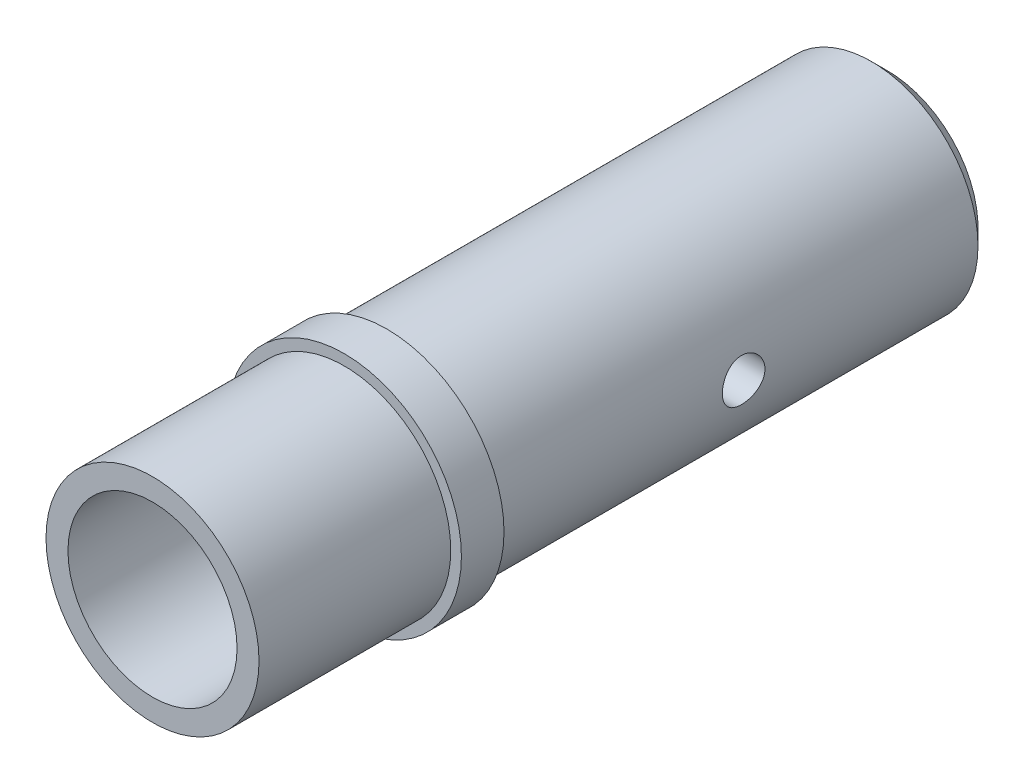
ISO-10303-21;
HEADER;
FILE_DESCRIPTION(('STEP AP214'),'2;1');
FILE_NAME('part.step','',(''),(''),'','','');
FILE_SCHEMA(('AUTOMOTIVE_DESIGN { 1 0 10303 214 1 1 1 1 }'));
ENDSEC;
DATA;
#1=APPLICATION_CONTEXT('core data for automotive mechanical design processes');
#2=APPLICATION_PROTOCOL_DEFINITION('international standard','automotive_design',2000,#1);
#3=PRODUCT_CONTEXT('',#1,'mechanical');
#4=PRODUCT('Part','Part','',(#3));
#5=PRODUCT_RELATED_PRODUCT_CATEGORY('part','',(#4));
#6=PRODUCT_DEFINITION_FORMATION('','',#4);
#7=PRODUCT_DEFINITION_CONTEXT('part definition',#1,'design');
#8=PRODUCT_DEFINITION('design','',#6,#7);
#9=PRODUCT_DEFINITION_SHAPE('','',#8);
#10=(LENGTH_UNIT() NAMED_UNIT(*) SI_UNIT(.MILLI.,.METRE.));
#11=(NAMED_UNIT(*) PLANE_ANGLE_UNIT() SI_UNIT($,.RADIAN.));
#12=(NAMED_UNIT(*) SI_UNIT($,.STERADIAN.) SOLID_ANGLE_UNIT());
#13=UNCERTAINTY_MEASURE_WITH_UNIT(LENGTH_MEASURE(1.E-05),#10,'distance_accuracy_value','');
#14=(GEOMETRIC_REPRESENTATION_CONTEXT(3) GLOBAL_UNCERTAINTY_ASSIGNED_CONTEXT((#13)) GLOBAL_UNIT_ASSIGNED_CONTEXT((#10,
#11,#12)) REPRESENTATION_CONTEXT('',''));
#15=CARTESIAN_POINT('',(0.,0.,0.));
#16=DIRECTION('',(0.,0.,1.));
#17=DIRECTION('',(1.,0.,0.));
#18=AXIS2_PLACEMENT_3D('',#15,#16,#17);
#19=CARTESIAN_POINT('',(0.,0.,18.));
#20=DIRECTION('',(0.,0.,1.));
#21=DIRECTION('',(1.,0.,0.));
#22=AXIS2_PLACEMENT_3D('',#19,#20,#21);
#23=PLANE('',#22);
#24=CARTESIAN_POINT('',(0.,0.,18.));
#25=DIRECTION('',(0.,0.,1.));
#26=DIRECTION('',(1.,0.,0.));
#27=AXIS2_PLACEMENT_3D('',#24,#25,#26);
#28=CIRCLE('',#27,10.);
#29=CARTESIAN_POINT('',(10.,0.,18.));
#30=VERTEX_POINT('',#29);
#31=EDGE_CURVE('E117',#30,#30,#28,.T.);
#32=ORIENTED_EDGE('',*,*,#31,.T.);
#33=EDGE_LOOP('',(#32));
#34=FACE_BOUND('',#33,.T.);
#35=CARTESIAN_POINT('',(0.,0.,18.));
#36=DIRECTION('',(0.,0.,1.));
#37=DIRECTION('',(1.,0.,0.));
#38=AXIS2_PLACEMENT_3D('',#35,#36,#37);
#39=CIRCLE('',#38,7.9375);
#40=CARTESIAN_POINT('',(7.9375,0.,18.));
#41=VERTEX_POINT('',#40);
#42=EDGE_CURVE('E121',#41,#41,#39,.T.);
#43=ORIENTED_EDGE('',*,*,#42,.F.);
#44=EDGE_LOOP('',(#43));
#45=FACE_BOUND('',#44,.T.);
#46=ADVANCED_FACE('F32',(#34,#45),#23,.T.);
#47=CARTESIAN_POINT('',(0.,0.,18.));
#48=DIRECTION('',(0.,0.,-1.));
#49=DIRECTION('',(-1.,0.,0.));
#50=AXIS2_PLACEMENT_3D('',#47,#48,#49);
#51=CYLINDRICAL_SURFACE('',#50,10.);
#52=ORIENTED_EDGE('',*,*,#31,.F.);
#53=EDGE_LOOP('',(#52));
#54=FACE_BOUND('',#53,.T.);
#55=CARTESIAN_POINT('',(0.,0.,0.));
#56=DIRECTION('',(0.,0.,1.));
#57=DIRECTION('',(1.,0.,0.));
#58=AXIS2_PLACEMENT_3D('',#55,#56,#57);
#59=CIRCLE('',#58,10.);
#60=CARTESIAN_POINT('',(10.,0.,0.));
#61=VERTEX_POINT('',#60);
#62=EDGE_CURVE('E120',#61,#61,#59,.T.);
#63=ORIENTED_EDGE('',*,*,#62,.T.);
#64=EDGE_LOOP('',(#63));
#65=FACE_BOUND('',#64,.T.);
#66=ADVANCED_FACE('F106',(#54,#65),#51,.T.);
#67=CARTESIAN_POINT('',(0.,0.,18.));
#68=DIRECTION('',(0.,0.,-1.));
#69=DIRECTION('',(-1.,0.,0.));
#70=AXIS2_PLACEMENT_3D('',#67,#68,#69);
#71=CYLINDRICAL_SURFACE('',#70,7.9375);
#72=ORIENTED_EDGE('',*,*,#42,.T.);
#73=EDGE_LOOP('',(#72));
#74=FACE_BOUND('',#73,.T.);
#75=CARTESIAN_POINT('',(0.,0.,-4.));
#76=DIRECTION('',(0.,0.,-1.));
#77=DIRECTION('',(-1.,0.,0.));
#78=AXIS2_PLACEMENT_3D('',#75,#76,#77);
#79=CIRCLE('',#78,7.9375);
#80=CARTESIAN_POINT('',(-7.9375,0.,-4.));
#81=VERTEX_POINT('',#80);
#82=EDGE_CURVE('E131',#81,#81,#79,.T.);
#83=ORIENTED_EDGE('',*,*,#82,.T.);
#84=EDGE_LOOP('',(#83));
#85=FACE_BOUND('',#84,.T.);
#86=ADVANCED_FACE('F94',(#74,#85),#71,.F.);
#87=CARTESIAN_POINT('',(0.,0.,-4.));
#88=DIRECTION('',(0.,0.,-1.));
#89=DIRECTION('',(-1.,0.,0.));
#90=AXIS2_PLACEMENT_3D('',#87,#88,#89);
#91=PLANE('',#90);
#92=CARTESIAN_POINT('',(0.,0.,-4.));
#93=DIRECTION('',(0.,0.,-1.));
#94=DIRECTION('',(-1.,0.,0.));
#95=AXIS2_PLACEMENT_3D('',#92,#93,#94);
#96=CIRCLE('',#95,10.);
#97=CARTESIAN_POINT('',(-10.,0.,-4.));
#98=VERTEX_POINT('',#97);
#99=EDGE_CURVE('E50',#98,#98,#96,.T.);
#100=ORIENTED_EDGE('',*,*,#99,.F.);
#101=EDGE_LOOP('',(#100));
#102=FACE_BOUND('',#101,.T.);
#103=CARTESIAN_POINT('',(0.,0.,-4.));
#104=DIRECTION('',(0.,0.,-1.));
#105=DIRECTION('',(-1.,0.,0.));
#106=AXIS2_PLACEMENT_3D('',#103,#104,#105);
#107=CIRCLE('',#106,11.);
#108=CARTESIAN_POINT('',(-11.,0.,-4.));
#109=VERTEX_POINT('',#108);
#110=EDGE_CURVE('E122',#109,#109,#107,.T.);
#111=ORIENTED_EDGE('',*,*,#110,.T.);
#112=EDGE_LOOP('',(#111));
#113=FACE_BOUND('',#112,.T.);
#114=ADVANCED_FACE('F89',(#102,#113),#91,.T.);
#115=CARTESIAN_POINT('',(0.,0.,0.));
#116=DIRECTION('',(0.,0.,-1.));
#117=DIRECTION('',(-1.,0.,0.));
#118=AXIS2_PLACEMENT_3D('',#115,#116,#117);
#119=PLANE('',#118);
#120=ORIENTED_EDGE('',*,*,#62,.F.);
#121=EDGE_LOOP('',(#120));
#122=FACE_BOUND('',#121,.T.);
#123=CARTESIAN_POINT('',(0.,0.,0.));
#124=DIRECTION('',(0.,0.,-1.));
#125=DIRECTION('',(-1.,0.,0.));
#126=AXIS2_PLACEMENT_3D('',#123,#124,#125);
#127=CIRCLE('',#126,11.);
#128=CARTESIAN_POINT('',(-11.,0.,0.));
#129=VERTEX_POINT('',#128);
#130=EDGE_CURVE('E126',#129,#129,#127,.T.);
#131=ORIENTED_EDGE('',*,*,#130,.F.);
#132=EDGE_LOOP('',(#131));
#133=FACE_BOUND('',#132,.T.);
#134=ADVANCED_FACE('F93',(#122,#133),#119,.F.);
#135=CARTESIAN_POINT('',(0.,0.,-4.));
#136=DIRECTION('',(0.,0.,1.));
#137=DIRECTION('',(1.,0.,0.));
#138=AXIS2_PLACEMENT_3D('',#135,#136,#137);
#139=CYLINDRICAL_SURFACE('',#138,11.);
#140=ORIENTED_EDGE('',*,*,#110,.F.);
#141=EDGE_LOOP('',(#140));
#142=FACE_BOUND('',#141,.T.);
#143=ORIENTED_EDGE('',*,*,#130,.T.);
#144=EDGE_LOOP('',(#143));
#145=FACE_BOUND('',#144,.T.);
#146=ADVANCED_FACE('F98',(#142,#145),#139,.T.);
#147=CARTESIAN_POINT('',(0.,0.,-51.));
#148=DIRECTION('',(0.,0.,-1.));
#149=DIRECTION('',(-1.,0.,0.));
#150=AXIS2_PLACEMENT_3D('',#147,#148,#149);
#151=PLANE('',#150);
#152=CARTESIAN_POINT('',(0.,0.,-51.));
#153=DIRECTION('',(0.,0.,-1.));
#154=DIRECTION('',(-1.,0.,0.));
#155=AXIS2_PLACEMENT_3D('',#152,#153,#154);
#156=CIRCLE('',#155,8.49999999999999);
#157=CARTESIAN_POINT('',(-8.49999999999999,0.,-51.));
#158=VERTEX_POINT('',#157);
#159=EDGE_CURVE('E45',#158,#158,#156,.T.);
#160=ORIENTED_EDGE('',*,*,#159,.T.);
#161=EDGE_LOOP('',(#160));
#162=FACE_BOUND('',#161,.T.);
#163=CARTESIAN_POINT('',(0.,0.,-51.));
#164=DIRECTION('',(0.,0.,-1.));
#165=DIRECTION('',(-1.,0.,0.));
#166=AXIS2_PLACEMENT_3D('',#163,#164,#165);
#167=CIRCLE('',#166,6.);
#168=CARTESIAN_POINT('',(-6.,0.,-51.));
#169=VERTEX_POINT('',#168);
#170=EDGE_CURVE('E135',#169,#169,#167,.T.);
#171=ORIENTED_EDGE('',*,*,#170,.F.);
#172=EDGE_LOOP('',(#171));
#173=FACE_BOUND('',#172,.T.);
#174=ADVANCED_FACE('F102',(#162,#173),#151,.T.);
#175=CARTESIAN_POINT('',(0.,0.,-4.));
#176=DIRECTION('',(0.,0.,-1.));
#177=DIRECTION('',(-1.,0.,0.));
#178=AXIS2_PLACEMENT_3D('',#175,#176,#177);
#179=PLANE('',#178);
#180=ORIENTED_EDGE('',*,*,#82,.F.);
#181=EDGE_LOOP('',(#180));
#182=FACE_BOUND('',#181,.T.);
#183=CARTESIAN_POINT('',(0.,0.,-4.));
#184=DIRECTION('',(0.,0.,-1.));
#185=DIRECTION('',(-1.,0.,0.));
#186=AXIS2_PLACEMENT_3D('',#183,#184,#185);
#187=CIRCLE('',#186,6.);
#188=CARTESIAN_POINT('',(-6.,0.,-4.));
#189=VERTEX_POINT('',#188);
#190=EDGE_CURVE('E138',#189,#189,#187,.T.);
#191=ORIENTED_EDGE('',*,*,#190,.T.);
#192=EDGE_LOOP('',(#191));
#193=FACE_BOUND('',#192,.T.);
#194=ADVANCED_FACE('F87',(#182,#193),#179,.F.);
#195=CARTESIAN_POINT('',(0.,0.,-51.));
#196=DIRECTION('',(0.,0.,1.));
#197=DIRECTION('',(1.,0.,0.));
#198=AXIS2_PLACEMENT_3D('',#195,#196,#197);
#199=CYLINDRICAL_SURFACE('',#198,10.);
#200=CARTESIAN_POINT('',(10.,0.,-29.5));
#201=CARTESIAN_POINT('',(9.99999795161742,-0.111153813585266,-29.4999959110033));
#202=CARTESIAN_POINT('',(9.99812770356462,-0.222359320403044,-29.4907023140647));
#203=CARTESIAN_POINT('',(9.99084731246463,-0.441627015378038,-29.4538029997695));
#204=CARTESIAN_POINT('',(9.98543435720372,-0.549686635082711,-29.426182734397));
#205=CARTESIAN_POINT('',(9.97167298556573,-0.759460610526624,-29.3535174527584));
#206=CARTESIAN_POINT('',(9.96332738153436,-0.861180935866265,-29.3084891263106));
#207=CARTESIAN_POINT('',(9.94460796070629,-1.05561597772845,-29.2023355049774));
#208=CARTESIAN_POINT('',(9.93423426471414,-1.14833123015162,-29.1412111687856));
#209=CARTESIAN_POINT('',(9.9124433065994,-1.32338695462973,-29.0037230114171));
#210=CARTESIAN_POINT('',(9.90101491008695,-1.40558790231705,-28.9271832892176));
#211=CARTESIAN_POINT('',(9.87848360905177,-1.55607351321606,-28.7614151672166));
#212=CARTESIAN_POINT('',(9.86738073000848,-1.62435708954085,-28.6721857773298));
#213=CARTESIAN_POINT('',(9.8466488362523,-1.74566350669524,-28.4825676139762));
#214=CARTESIAN_POINT('',(9.83703414729892,-1.79854187773173,-28.3820847124073));
#215=CARTESIAN_POINT('',(9.82052536116836,-1.88661133316062,-28.1734363619918));
#216=CARTESIAN_POINT('',(9.81363099523923,-1.92180416487447,-28.0652716733073));
#217=CARTESIAN_POINT('',(9.80345610504409,-1.97305059976965,-27.8458312721842));
#218=CARTESIAN_POINT('',(9.80012940214375,-1.98934899591755,-27.7346149117155));
#219=CARTESIAN_POINT('',(9.79732750121254,-2.00310425545224,-27.5109803572713));
#220=CARTESIAN_POINT('',(9.79785190935681,-2.000563045427,-27.3985622873597));
#221=CARTESIAN_POINT('',(9.80265102296369,-1.97690914620364,-27.177506423958));
#222=CARTESIAN_POINT('',(9.80686905717527,-1.95607708048781,-27.0688371887454));
#223=CARTESIAN_POINT('',(9.81849092320002,-1.8968757692461,-26.856567846674));
#224=CARTESIAN_POINT('',(9.82589490715558,-1.85850568620136,-26.752967982162));
#225=CARTESIAN_POINT('',(9.84311237000816,-1.76504956734944,-26.5529694765928));
#226=CARTESIAN_POINT('',(9.85294179627409,-1.70985230246423,-26.4566242408617));
#227=CARTESIAN_POINT('',(9.87389237546124,-1.58438714914536,-26.2744583000544));
#228=CARTESIAN_POINT('',(9.88501367676732,-1.51411752871366,-26.1886388062977));
#229=CARTESIAN_POINT('',(9.90754042482924,-1.35899986912117,-26.0283411950861));
#230=CARTESIAN_POINT('',(9.9189473842181,-1.27391232242489,-25.9540948642817));
#231=CARTESIAN_POINT('',(9.94057697428817,-1.09237004812402,-25.8208923073976));
#232=CARTESIAN_POINT('',(9.95079958977947,-0.995915174758778,-25.7619362774128));
#233=CARTESIAN_POINT('',(9.96893380321774,-0.794118773757842,-25.660944981548));
#234=CARTESIAN_POINT('',(9.97684177696544,-0.688763639170601,-25.6189362127109));
#235=CARTESIAN_POINT('',(9.98942817975716,-0.47229795289733,-25.5532790519229));
#236=CARTESIAN_POINT('',(9.99410700001063,-0.3611881001449,-25.5296284358527));
#237=CARTESIAN_POINT('',(9.99965343733736,-0.138358811254301,-25.5016870924114));
#238=CARTESIAN_POINT('',(10.0005834930494,-0.0266806566511533,-25.4970791609195));
#239=CARTESIAN_POINT('',(9.99870103860205,0.195849868385427,-25.5064997178844));
#240=CARTESIAN_POINT('',(9.99588873882892,0.306702284887585,-25.5205271587052));
#241=CARTESIAN_POINT('',(9.98687664016035,0.52341131989308,-25.5665567470879));
#242=CARTESIAN_POINT('',(9.98070752808413,0.629303896679805,-25.5983961369958));
#243=CARTESIAN_POINT('',(9.96567104122065,0.834247254999333,-25.6789679653116));
#244=CARTESIAN_POINT('',(9.95680346428454,0.933297523275077,-25.7277016693537));
#245=CARTESIAN_POINT('',(9.93719823066589,1.12308234737243,-25.8413649813026));
#246=CARTESIAN_POINT('',(9.92643900874103,1.21370025350437,-25.9064855620779));
#247=CARTESIAN_POINT('',(9.90429469659765,1.38283603823841,-26.0508183824146));
#248=CARTESIAN_POINT('',(9.89290953936776,1.46135261786152,-26.1300321327997));
#249=CARTESIAN_POINT('',(9.8705860711393,1.60528118154835,-26.3017467037822));
#250=CARTESIAN_POINT('',(9.85965720466609,1.67047540489731,-26.3944314884427));
#251=CARTESIAN_POINT('',(9.83968383592389,1.78437084010241,-26.5896227227134));
#252=CARTESIAN_POINT('',(9.83063925826685,1.8330727118458,-26.6921287791471));
#253=CARTESIAN_POINT('',(9.81553481168766,1.91230368316392,-26.9035364922991));
#254=CARTESIAN_POINT('',(9.80945949744373,1.9429269995821,-27.0124016824206));
#255=CARTESIAN_POINT('',(9.8009487358405,1.98541730325439,-27.2338669069818));
#256=CARTESIAN_POINT('',(9.79851281382223,1.99728673645022,-27.3464664524187));
#257=CARTESIAN_POINT('',(9.79758299262758,2.00184182173494,-27.5700177290886));
#258=CARTESIAN_POINT('',(9.79901838378602,1.99487157614179,-27.680962297854));
#259=CARTESIAN_POINT('',(9.80551146969228,1.96270460820012,-27.90006329981));
#260=CARTESIAN_POINT('',(9.81056913534338,1.9375080322586,-28.0082197553896));
#261=CARTESIAN_POINT('',(9.82370528438317,1.86975713699791,-28.2184554224811));
#262=CARTESIAN_POINT('',(9.83177642037661,1.82724501343469,-28.3205487210048));
#263=CARTESIAN_POINT('',(9.85003429948341,1.72610928920321,-28.5162074414689));
#264=CARTESIAN_POINT('',(9.86022121997788,1.66748433754977,-28.6097721474503));
#265=CARTESIAN_POINT('',(9.88177921046451,1.53461182957283,-28.7874311443006));
#266=CARTESIAN_POINT('',(9.89316745819399,1.46011577447036,-28.8713375305352));
#267=CARTESIAN_POINT('',(9.91572163743909,1.29812873802628,-29.0255724110583));
#268=CARTESIAN_POINT('',(9.92688751726369,1.21063477430667,-29.0958977806345));
#269=CARTESIAN_POINT('',(9.94787664775943,1.02403525817649,-29.2216692878929));
#270=CARTESIAN_POINT('',(9.95768462438492,0.924817768859668,-29.27695200656));
#271=CARTESIAN_POINT('',(9.9747025017,0.718332721881464,-29.3699722451932));
#272=CARTESIAN_POINT('',(9.98191474277232,0.611072521726252,-29.407725579065));
#273=CARTESIAN_POINT('',(9.99152745190741,0.41964297784756,-29.4573038960894));
#274=CARTESIAN_POINT('',(9.99468606316904,0.33656332802757,-29.4732863874155));
#275=CARTESIAN_POINT('',(9.99892308279786,0.168999050420134,-29.4946358247167));
#276=CARTESIAN_POINT('',(10.0000015574631,0.0845144674972382,-29.5000031090195));
#277=CARTESIAN_POINT('',(10.,0.,-29.5));
#278=B_SPLINE_CURVE_WITH_KNOTS('',3,(#200,#201,#202,#203,#204,#205,#206,#207,#208,#209,#210,
#211,#212,#213,#214,#215,#216,#217,#218,#219,#220,#221,#222,#223,#224,#225,#226,#227,#228,#229,
#230,#231,#232,#233,#234,#235,#236,#237,#238,#239,#240,#241,#242,#243,#244,#245,#246,#247,#248,
#249,#250,#251,#252,#253,#254,#255,#256,#257,#258,#259,#260,#261,#262,#263,#264,#265,#266,#267,
#268,#269,#270,#271,#272,#273,#274,#275,#276,#277),.UNSPECIFIED.,.T.,.F.,(4,2,2,2,2,2,2,2,2,2,2,
2,2,2,2,2,2,2,2,2,2,2,2,2,2,2,2,2,2,2,2,2,2,2,2,2,2,2,4),(0.,0.333152261322517,
0.666569301382645,0.99966747050068,1.33274580446172,1.66986534022437,2.00701119349473,
2.34722390011845,2.68740298730395,3.02312370207174,3.3588100856245,3.68943454012556,
4.02007478507459,4.35294980407185,4.68586309499341,5.02476504982701,5.3636713507964,
5.70310549708047,6.04249851396072,6.3762147135253,6.70991215315735,7.04060907901447,
7.37133078432044,7.70610132066717,8.0409077669186,8.38081257158451,8.72070377446933,
9.05880762065446,9.39686736660829,9.72879445135402,10.0607188698522,10.3918392250622,
10.7229873516373,11.0597615247829,11.3966130906586,11.7369899335127,12.0770591103504,
12.3303755057979,12.5836838274199),.UNSPECIFIED.);
#279=CARTESIAN_POINT('',(10.,0.,-29.5));
#280=VERTEX_POINT('',#279);
#281=EDGE_CURVE('E77',#280,#280,#278,.T.);
#282=ORIENTED_EDGE('',*,*,#281,.T.);
#283=EDGE_LOOP('',(#282));
#284=FACE_BOUND('',#283,.T.);
#285=CARTESIAN_POINT('',(-10.,0.,-29.5));
#286=CARTESIAN_POINT('',(-9.99999795161742,0.111153813585266,-29.4999959110033));
#287=CARTESIAN_POINT('',(-9.99812770356462,0.222359320403044,-29.4907023140647));
#288=CARTESIAN_POINT('',(-9.99084731246463,0.441627015378038,-29.4538029997695));
#289=CARTESIAN_POINT('',(-9.98543435720372,0.549686635082711,-29.426182734397));
#290=CARTESIAN_POINT('',(-9.97167298556573,0.759460610526624,-29.3535174527584));
#291=CARTESIAN_POINT('',(-9.96332738153436,0.861180935866265,-29.3084891263106));
#292=CARTESIAN_POINT('',(-9.94460796070629,1.05561597772845,-29.2023355049774));
#293=CARTESIAN_POINT('',(-9.93423426471414,1.14833123015162,-29.1412111687856));
#294=CARTESIAN_POINT('',(-9.9124433065994,1.32338695462973,-29.0037230114171));
#295=CARTESIAN_POINT('',(-9.90101491008695,1.40558790231705,-28.9271832892176));
#296=CARTESIAN_POINT('',(-9.87848360905177,1.55607351321606,-28.7614151672166));
#297=CARTESIAN_POINT('',(-9.86738073000848,1.62435708954085,-28.6721857773298));
#298=CARTESIAN_POINT('',(-9.8466488362523,1.74566350669524,-28.4825676139762));
#299=CARTESIAN_POINT('',(-9.83703414729892,1.79854187773173,-28.3820847124073));
#300=CARTESIAN_POINT('',(-9.82052536116836,1.88661133316062,-28.1734363619918));
#301=CARTESIAN_POINT('',(-9.81363099523923,1.92180416487447,-28.0652716733073));
#302=CARTESIAN_POINT('',(-9.80345610504409,1.97305059976965,-27.8458312721842));
#303=CARTESIAN_POINT('',(-9.80012940214375,1.98934899591755,-27.7346149117155));
#304=CARTESIAN_POINT('',(-9.79732750121254,2.00310425545224,-27.5109803572713));
#305=CARTESIAN_POINT('',(-9.79785190935681,2.000563045427,-27.3985622873597));
#306=CARTESIAN_POINT('',(-9.80265102296369,1.97690914620364,-27.177506423958));
#307=CARTESIAN_POINT('',(-9.80686905717527,1.95607708048781,-27.0688371887454));
#308=CARTESIAN_POINT('',(-9.81849092320002,1.8968757692461,-26.856567846674));
#309=CARTESIAN_POINT('',(-9.82589490715558,1.85850568620136,-26.752967982162));
#310=CARTESIAN_POINT('',(-9.84311237000816,1.76504956734944,-26.5529694765928));
#311=CARTESIAN_POINT('',(-9.85294179627409,1.70985230246423,-26.4566242408617));
#312=CARTESIAN_POINT('',(-9.87389237546124,1.58438714914536,-26.2744583000544));
#313=CARTESIAN_POINT('',(-9.88501367676732,1.51411752871366,-26.1886388062977));
#314=CARTESIAN_POINT('',(-9.90754042482924,1.35899986912117,-26.0283411950861));
#315=CARTESIAN_POINT('',(-9.9189473842181,1.27391232242489,-25.9540948642817));
#316=CARTESIAN_POINT('',(-9.94057697428817,1.09237004812402,-25.8208923073976));
#317=CARTESIAN_POINT('',(-9.95079958977947,0.995915174758778,-25.7619362774128));
#318=CARTESIAN_POINT('',(-9.96893380321774,0.794118773757842,-25.660944981548));
#319=CARTESIAN_POINT('',(-9.97684177696544,0.688763639170601,-25.6189362127109));
#320=CARTESIAN_POINT('',(-9.98942817975716,0.47229795289733,-25.5532790519229));
#321=CARTESIAN_POINT('',(-9.99410700001063,0.3611881001449,-25.5296284358527));
#322=CARTESIAN_POINT('',(-9.99965343733736,0.138358811254301,-25.5016870924114));
#323=CARTESIAN_POINT('',(-10.0005834930494,0.0266806566511533,-25.4970791609195));
#324=CARTESIAN_POINT('',(-9.99870103860205,-0.195849868385427,-25.5064997178844));
#325=CARTESIAN_POINT('',(-9.99588873882892,-0.306702284887585,-25.5205271587052));
#326=CARTESIAN_POINT('',(-9.98687664016035,-0.52341131989308,-25.5665567470879));
#327=CARTESIAN_POINT('',(-9.98070752808413,-0.629303896679805,-25.5983961369958));
#328=CARTESIAN_POINT('',(-9.96567104122065,-0.834247254999333,-25.6789679653116));
#329=CARTESIAN_POINT('',(-9.95680346428454,-0.933297523275077,-25.7277016693537));
#330=CARTESIAN_POINT('',(-9.93719823066589,-1.12308234737243,-25.8413649813026));
#331=CARTESIAN_POINT('',(-9.92643900874103,-1.21370025350437,-25.9064855620779));
#332=CARTESIAN_POINT('',(-9.90429469659765,-1.38283603823841,-26.0508183824146));
#333=CARTESIAN_POINT('',(-9.89290953936776,-1.46135261786152,-26.1300321327997));
#334=CARTESIAN_POINT('',(-9.8705860711393,-1.60528118154835,-26.3017467037822));
#335=CARTESIAN_POINT('',(-9.85965720466609,-1.67047540489731,-26.3944314884427));
#336=CARTESIAN_POINT('',(-9.83968383592389,-1.78437084010241,-26.5896227227134));
#337=CARTESIAN_POINT('',(-9.83063925826685,-1.8330727118458,-26.6921287791471));
#338=CARTESIAN_POINT('',(-9.81553481168766,-1.91230368316392,-26.9035364922991));
#339=CARTESIAN_POINT('',(-9.80945949744373,-1.9429269995821,-27.0124016824206));
#340=CARTESIAN_POINT('',(-9.8009487358405,-1.98541730325439,-27.2338669069818));
#341=CARTESIAN_POINT('',(-9.79851281382223,-1.99728673645022,-27.3464664524187));
#342=CARTESIAN_POINT('',(-9.79758299262758,-2.00184182173494,-27.5700177290886));
#343=CARTESIAN_POINT('',(-9.79901838378602,-1.99487157614179,-27.680962297854));
#344=CARTESIAN_POINT('',(-9.80551146969228,-1.96270460820012,-27.90006329981));
#345=CARTESIAN_POINT('',(-9.81056913534338,-1.9375080322586,-28.0082197553896));
#346=CARTESIAN_POINT('',(-9.82370528438317,-1.86975713699791,-28.2184554224811));
#347=CARTESIAN_POINT('',(-9.83177642037661,-1.82724501343469,-28.3205487210048));
#348=CARTESIAN_POINT('',(-9.85003429948341,-1.72610928920321,-28.5162074414689));
#349=CARTESIAN_POINT('',(-9.86022121997788,-1.66748433754977,-28.6097721474503));
#350=CARTESIAN_POINT('',(-9.88177921046451,-1.53461182957283,-28.7874311443006));
#351=CARTESIAN_POINT('',(-9.89316745819399,-1.46011577447036,-28.8713375305352));
#352=CARTESIAN_POINT('',(-9.91572163743909,-1.29812873802628,-29.0255724110583));
#353=CARTESIAN_POINT('',(-9.92688751726369,-1.21063477430667,-29.0958977806345));
#354=CARTESIAN_POINT('',(-9.94787664775943,-1.02403525817649,-29.2216692878929));
#355=CARTESIAN_POINT('',(-9.95768462438492,-0.924817768859668,-29.27695200656));
#356=CARTESIAN_POINT('',(-9.9747025017,-0.718332721881464,-29.3699722451932));
#357=CARTESIAN_POINT('',(-9.98191474277232,-0.611072521726252,-29.407725579065));
#358=CARTESIAN_POINT('',(-9.99152745190741,-0.41964297784756,-29.4573038960894));
#359=CARTESIAN_POINT('',(-9.99468606316904,-0.33656332802757,-29.4732863874155));
#360=CARTESIAN_POINT('',(-9.99892308279786,-0.168999050420134,-29.4946358247167));
#361=CARTESIAN_POINT('',(-10.0000015574631,-0.0845144674972382,-29.5000031090195));
#362=CARTESIAN_POINT('',(-10.,0.,-29.5));
#363=B_SPLINE_CURVE_WITH_KNOTS('',3,(#285,#286,#287,#288,#289,#290,#291,#292,#293,#294,#295,
#296,#297,#298,#299,#300,#301,#302,#303,#304,#305,#306,#307,#308,#309,#310,#311,#312,#313,#314,
#315,#316,#317,#318,#319,#320,#321,#322,#323,#324,#325,#326,#327,#328,#329,#330,#331,#332,#333,
#334,#335,#336,#337,#338,#339,#340,#341,#342,#343,#344,#345,#346,#347,#348,#349,#350,#351,#352,
#353,#354,#355,#356,#357,#358,#359,#360,#361,#362),.UNSPECIFIED.,.T.,.F.,(4,2,2,2,2,2,2,2,2,2,2,
2,2,2,2,2,2,2,2,2,2,2,2,2,2,2,2,2,2,2,2,2,2,2,2,2,2,2,4),(0.,0.333152261322517,
0.666569301382645,0.99966747050068,1.33274580446172,1.66986534022437,2.00701119349473,
2.34722390011845,2.68740298730395,3.02312370207174,3.3588100856245,3.68943454012556,
4.02007478507459,4.35294980407185,4.68586309499341,5.02476504982701,5.3636713507964,
5.70310549708047,6.04249851396072,6.3762147135253,6.70991215315735,7.04060907901447,
7.37133078432044,7.70610132066717,8.0409077669186,8.38081257158451,8.72070377446933,
9.05880762065446,9.39686736660829,9.72879445135402,10.0607188698522,10.3918392250622,
10.7229873516373,11.0597615247829,11.3966130906586,11.7369899335127,12.0770591103504,
12.3303755057979,12.5836838274199),.UNSPECIFIED.);
#364=CARTESIAN_POINT('',(-10.,0.,-29.5));
#365=VERTEX_POINT('',#364);
#366=EDGE_CURVE('E71',#365,#365,#363,.T.);
#367=ORIENTED_EDGE('',*,*,#366,.T.);
#368=EDGE_LOOP('',(#367));
#369=FACE_BOUND('',#368,.T.);
#370=CARTESIAN_POINT('',(0.,0.,-49.5));
#371=DIRECTION('',(0.,0.,-1.));
#372=DIRECTION('',(-1.,0.,0.));
#373=AXIS2_PLACEMENT_3D('',#370,#371,#372);
#374=CIRCLE('',#373,10.);
#375=CARTESIAN_POINT('',(-10.,0.,-49.5));
#376=VERTEX_POINT('',#375);
#377=EDGE_CURVE('E10',#376,#376,#374,.F.);
#378=ORIENTED_EDGE('',*,*,#377,.T.);
#379=EDGE_LOOP('',(#378));
#380=FACE_BOUND('',#379,.T.);
#381=ORIENTED_EDGE('',*,*,#99,.T.);
#382=EDGE_LOOP('',(#381));
#383=FACE_BOUND('',#382,.T.);
#384=ADVANCED_FACE('F82',(#284,#369,#380,#383),#199,.T.);
#385=CARTESIAN_POINT('',(0.,0.,-51.));
#386=DIRECTION('',(0.,0.,1.));
#387=DIRECTION('',(1.,0.,0.));
#388=AXIS2_PLACEMENT_3D('',#385,#386,#387);
#389=CYLINDRICAL_SURFACE('',#388,6.);
#390=CARTESIAN_POINT('',(6.,0.,-29.5));
#391=CARTESIAN_POINT('',(6.00000030601888,-0.109126725773446,-29.5000005074633));
#392=CARTESIAN_POINT('',(5.9969953901509,-0.2182503890771,-29.4910394677456));
#393=CARTESIAN_POINT('',(5.98530420406561,-0.433283521745944,-29.4555417823656));
#394=CARTESIAN_POINT('',(5.97661734404305,-0.539192656237635,-29.4290033121022));
#395=CARTESIAN_POINT('',(5.95450615812885,-0.744665579003552,-29.3593615132319));
#396=CARTESIAN_POINT('',(5.94108975461707,-0.844239651772069,-29.3162858750815));
#397=CARTESIAN_POINT('',(5.91088891434684,-1.03474987361065,-29.2149176543233));
#398=CARTESIAN_POINT('',(5.89410381335556,-1.12568431391741,-29.1566220699948));
#399=CARTESIAN_POINT('',(5.8582818888601,-1.29948335004453,-29.0243483902825));
#400=CARTESIAN_POINT('',(5.8391911292757,-1.38200740059662,-28.949937531479));
#401=CARTESIAN_POINT('',(5.80120629566243,-1.53366538540417,-28.7884656905869));
#402=CARTESIAN_POINT('',(5.78231226581098,-1.60279637097892,-28.701401930143));
#403=CARTESIAN_POINT('',(5.74626664954548,-1.72764988445572,-28.5140297696071));
#404=CARTESIAN_POINT('',(5.72918078551377,-1.78292971644206,-28.4134125205358));
#405=CARTESIAN_POINT('',(5.69950610837202,-1.87563774775544,-28.2036478110829));
#406=CARTESIAN_POINT('',(5.68691592321491,-1.91307139477353,-28.0945029656745));
#407=CARTESIAN_POINT('',(5.66822606538755,-1.96774692301833,-27.8746535570066));
#408=CARTESIAN_POINT('',(5.66192191539223,-1.98562689654354,-27.7641255830219));
#409=CARTESIAN_POINT('',(5.65591313259015,-2.00268224666895,-27.5414724916882));
#410=CARTESIAN_POINT('',(5.6562064604546,-2.00186340320944,-27.4293478785816));
#411=CARTESIAN_POINT('',(5.6631803001636,-1.98203980740684,-27.212126739112));
#412=CARTESIAN_POINT('',(5.66956831735066,-1.96386782633399,-27.106943194162));
#413=CARTESIAN_POINT('',(5.68753315449102,-1.91121232569883,-26.9012131607863));
#414=CARTESIAN_POINT('',(5.69911059568215,-1.87672685318374,-26.8006672291299));
#415=CARTESIAN_POINT('',(5.72635822262498,-1.79187811612042,-26.605174500817));
#416=CARTESIAN_POINT('',(5.74209131586235,-1.74126809741452,-26.5103439490609));
#417=CARTESIAN_POINT('',(5.77585117151453,-1.62577821260628,-26.3302581834405));
#418=CARTESIAN_POINT('',(5.79387859580927,-1.56089422472801,-26.2450057461332));
#419=CARTESIAN_POINT('',(5.83134658335482,-1.41469866536447,-26.0818168036785));
#420=CARTESIAN_POINT('',(5.85081178709686,-1.33270630015262,-26.0044946109819));
#421=CARTESIAN_POINT('',(5.88813876774073,-1.15667913994013,-25.8645374666732));
#422=CARTESIAN_POINT('',(5.90600039076135,-1.06264319132163,-25.801903923671));
#423=CARTESIAN_POINT('',(5.93834215875587,-0.863895226092535,-25.6926073995299));
#424=CARTESIAN_POINT('',(5.95278700016078,-0.759086552832674,-25.6461090173185));
#425=CARTESIAN_POINT('',(5.9764113428887,-0.542538166729016,-25.5715936520886));
#426=CARTESIAN_POINT('',(5.98559267309759,-0.430800876309908,-25.5435702491531));
#427=CARTESIAN_POINT('',(5.99735254142881,-0.208767659058608,-25.5078886679553));
#428=CARTESIAN_POINT('',(6.00020003667456,-0.0986191997296924,-25.4994003816545));
#429=CARTESIAN_POINT('',(5.99977805389655,0.121550139920475,-25.5006653471969));
#430=CARTESIAN_POINT('',(5.99650960838725,0.231571038639301,-25.5104155199598));
#431=CARTESIAN_POINT('',(5.98440049434209,0.445039732608511,-25.5472238154719));
#432=CARTESIAN_POINT('',(5.97572397422385,0.548585613669687,-25.573772412099));
#433=CARTESIAN_POINT('',(5.9538369366014,0.749711917159147,-25.6427868889335));
#434=CARTESIAN_POINT('',(5.9406258409335,0.847291577017212,-25.6852547989356));
#435=CARTESIAN_POINT('',(5.9105786257458,1.03657659278655,-25.7861408636816));
#436=CARTESIAN_POINT('',(5.89365629511572,1.12805991843429,-25.8449491865663));
#437=CARTESIAN_POINT('',(5.85810507832525,1.30012966027117,-25.976388300027));
#438=CARTESIAN_POINT('',(5.83947567187655,1.38071273559115,-26.0490233120635));
#439=CARTESIAN_POINT('',(5.8015369596089,1.5325050156126,-26.2099575020132));
#440=CARTESIAN_POINT('',(5.78223522174856,1.60312193849154,-26.2988184538537));
#441=CARTESIAN_POINT('',(5.74599946589418,1.72851504464715,-26.4875431356218));
#442=CARTESIAN_POINT('',(5.72906546764005,1.78329109586202,-26.5874069572682));
#443=CARTESIAN_POINT('',(5.69964783582767,1.87519386083272,-26.7953460305798));
#444=CARTESIAN_POINT('',(5.68715521585958,1.91235626433004,-26.9034041583375));
#445=CARTESIAN_POINT('',(5.66821664612899,1.96778933351871,-27.1247573000883));
#446=CARTESIAN_POINT('',(5.66176797247279,1.98606850990788,-27.2380499308087));
#447=CARTESIAN_POINT('',(5.65595717748355,2.00255256495468,-27.4603941920818));
#448=CARTESIAN_POINT('',(5.6562480051483,2.0017405146168,-27.5693646805736));
#449=CARTESIAN_POINT('',(5.66302539647735,1.98248458689739,-27.7855301498441));
#450=CARTESIAN_POINT('',(5.66951159138723,1.96404175891717,-27.8927252359102));
#451=CARTESIAN_POINT('',(5.68769048609783,1.91074362625869,-28.1002713260049));
#452=CARTESIAN_POINT('',(5.69928196044955,1.87620669203103,-28.200713650009));
#453=CARTESIAN_POINT('',(5.72632797636937,1.79195873151949,-28.3944548138765));
#454=CARTESIAN_POINT('',(5.74178337526786,1.74224433710761,-28.487752062376));
#455=CARTESIAN_POINT('',(5.77565658452092,1.62652138516686,-28.6689673398458));
#456=CARTESIAN_POINT('',(5.79417423284274,1.55989648552916,-28.7564730037968));
#457=CARTESIAN_POINT('',(5.83166712566506,1.4132857662713,-28.9193796267684));
#458=CARTESIAN_POINT('',(5.85064249824745,1.33329616890297,-28.9947771513761));
#459=CARTESIAN_POINT('',(5.88780061051088,1.15848311384138,-29.1342888245784));
#460=CARTESIAN_POINT('',(5.90592363602513,1.06320302699946,-29.197848695502));
#461=CARTESIAN_POINT('',(5.93851982345224,0.862714714813251,-29.3079808577013));
#462=CARTESIAN_POINT('',(5.9529939181586,0.757509036264698,-29.3545574918441));
#463=CARTESIAN_POINT('',(5.97611030137084,0.544987294401952,-29.4274432649773));
#464=CARTESIAN_POINT('',(5.98498424845045,0.437975515352818,-29.4545649325268));
#465=CARTESIAN_POINT('',(5.99692814128444,0.220640832020494,-29.4908405613543));
#466=CARTESIAN_POINT('',(5.9999996906381,0.110318851137493,-29.4999994869931));
#467=CARTESIAN_POINT('',(6.,0.,-29.5));
#468=B_SPLINE_CURVE_WITH_KNOTS('',3,(#390,#391,#392,#393,#394,#395,#396,#397,#398,#399,#400,
#401,#402,#403,#404,#405,#406,#407,#408,#409,#410,#411,#412,#413,#414,#415,#416,#417,#418,#419,
#420,#421,#422,#423,#424,#425,#426,#427,#428,#429,#430,#431,#432,#433,#434,#435,#436,#437,#438,
#439,#440,#441,#442,#443,#444,#445,#446,#447,#448,#449,#450,#451,#452,#453,#454,#455,#456,#457,
#458,#459,#460,#461,#462,#463,#464,#465,#466,#467),.UNSPECIFIED.,.T.,.F.,(4,2,2,2,2,2,2,2,2,2,2,
2,2,2,2,2,2,2,2,2,2,2,2,2,2,2,2,2,2,2,2,2,2,2,2,2,2,2,4),(0.,0.326974212052021,
0.653982370535041,0.980445345740548,1.3069727555982,1.64369368565512,1.9804886657506,
2.32696769646941,2.67334089385667,3.0080385148368,3.34263267974971,3.6619365310256,
3.98127861710964,4.30576342310261,4.63034205116414,4.97186611622734,5.31342291933236,
5.65836811300715,6.00319337754416,6.33307166350339,6.66289426328353,6.98316315956427,
7.30347290568207,7.63220799687472,7.96104361643782,8.30482045761503,8.64860016469992,
8.9916802765354,9.3346056941168,9.65991332128516,9.9852015870275,10.3043117416083,
10.6234927635195,10.9566013338361,11.2898042224756,11.635993216702,11.9820936230491,
12.3127311674763,12.6432773207628),.UNSPECIFIED.);
#469=CARTESIAN_POINT('',(6.,0.,-29.5));
#470=VERTEX_POINT('',#469);
#471=EDGE_CURVE('E36',#470,#470,#468,.T.);
#472=ORIENTED_EDGE('',*,*,#471,.F.);
#473=EDGE_LOOP('',(#472));
#474=FACE_BOUND('',#473,.T.);
#475=CARTESIAN_POINT('',(-6.,0.,-29.5));
#476=CARTESIAN_POINT('',(-6.00000030601888,0.109126725773446,-29.5000005074633));
#477=CARTESIAN_POINT('',(-5.9969953901509,0.2182503890771,-29.4910394677456));
#478=CARTESIAN_POINT('',(-5.98530420406561,0.433283521745944,-29.4555417823656));
#479=CARTESIAN_POINT('',(-5.97661734404305,0.539192656237635,-29.4290033121022));
#480=CARTESIAN_POINT('',(-5.95450615812885,0.744665579003552,-29.3593615132319));
#481=CARTESIAN_POINT('',(-5.94108975461707,0.844239651772069,-29.3162858750815));
#482=CARTESIAN_POINT('',(-5.91088891434684,1.03474987361065,-29.2149176543233));
#483=CARTESIAN_POINT('',(-5.89410381335556,1.12568431391741,-29.1566220699948));
#484=CARTESIAN_POINT('',(-5.8582818888601,1.29948335004453,-29.0243483902825));
#485=CARTESIAN_POINT('',(-5.8391911292757,1.38200740059662,-28.949937531479));
#486=CARTESIAN_POINT('',(-5.80120629566243,1.53366538540417,-28.7884656905869));
#487=CARTESIAN_POINT('',(-5.78231226581098,1.60279637097892,-28.701401930143));
#488=CARTESIAN_POINT('',(-5.74626664954548,1.72764988445572,-28.5140297696071));
#489=CARTESIAN_POINT('',(-5.72918078551377,1.78292971644206,-28.4134125205358));
#490=CARTESIAN_POINT('',(-5.69950610837202,1.87563774775544,-28.2036478110829));
#491=CARTESIAN_POINT('',(-5.68691592321491,1.91307139477353,-28.0945029656745));
#492=CARTESIAN_POINT('',(-5.66822606538755,1.96774692301833,-27.8746535570066));
#493=CARTESIAN_POINT('',(-5.66192191539223,1.98562689654354,-27.7641255830219));
#494=CARTESIAN_POINT('',(-5.65591313259015,2.00268224666895,-27.5414724916882));
#495=CARTESIAN_POINT('',(-5.6562064604546,2.00186340320944,-27.4293478785816));
#496=CARTESIAN_POINT('',(-5.6631803001636,1.98203980740684,-27.212126739112));
#497=CARTESIAN_POINT('',(-5.66956831735066,1.96386782633399,-27.106943194162));
#498=CARTESIAN_POINT('',(-5.68753315449102,1.91121232569883,-26.9012131607863));
#499=CARTESIAN_POINT('',(-5.69911059568215,1.87672685318374,-26.8006672291299));
#500=CARTESIAN_POINT('',(-5.72635822262498,1.79187811612042,-26.605174500817));
#501=CARTESIAN_POINT('',(-5.74209131586235,1.74126809741452,-26.5103439490609));
#502=CARTESIAN_POINT('',(-5.77585117151453,1.62577821260628,-26.3302581834405));
#503=CARTESIAN_POINT('',(-5.79387859580927,1.56089422472801,-26.2450057461332));
#504=CARTESIAN_POINT('',(-5.83134658335482,1.41469866536447,-26.0818168036785));
#505=CARTESIAN_POINT('',(-5.85081178709686,1.33270630015262,-26.0044946109819));
#506=CARTESIAN_POINT('',(-5.88813876774073,1.15667913994013,-25.8645374666732));
#507=CARTESIAN_POINT('',(-5.90600039076135,1.06264319132163,-25.801903923671));
#508=CARTESIAN_POINT('',(-5.93834215875587,0.863895226092535,-25.6926073995299));
#509=CARTESIAN_POINT('',(-5.95278700016078,0.759086552832674,-25.6461090173185));
#510=CARTESIAN_POINT('',(-5.9764113428887,0.542538166729016,-25.5715936520886));
#511=CARTESIAN_POINT('',(-5.98559267309759,0.430800876309908,-25.5435702491531));
#512=CARTESIAN_POINT('',(-5.99735254142881,0.208767659058608,-25.5078886679553));
#513=CARTESIAN_POINT('',(-6.00020003667456,0.0986191997296924,-25.4994003816545));
#514=CARTESIAN_POINT('',(-5.99977805389655,-0.121550139920475,-25.5006653471969));
#515=CARTESIAN_POINT('',(-5.99650960838725,-0.231571038639301,-25.5104155199598));
#516=CARTESIAN_POINT('',(-5.98440049434209,-0.445039732608511,-25.5472238154719));
#517=CARTESIAN_POINT('',(-5.97572397422385,-0.548585613669687,-25.573772412099));
#518=CARTESIAN_POINT('',(-5.9538369366014,-0.749711917159147,-25.6427868889335));
#519=CARTESIAN_POINT('',(-5.9406258409335,-0.847291577017212,-25.6852547989356));
#520=CARTESIAN_POINT('',(-5.9105786257458,-1.03657659278655,-25.7861408636816));
#521=CARTESIAN_POINT('',(-5.89365629511572,-1.12805991843429,-25.8449491865663));
#522=CARTESIAN_POINT('',(-5.85810507832525,-1.30012966027117,-25.976388300027));
#523=CARTESIAN_POINT('',(-5.83947567187655,-1.38071273559115,-26.0490233120635));
#524=CARTESIAN_POINT('',(-5.8015369596089,-1.5325050156126,-26.2099575020132));
#525=CARTESIAN_POINT('',(-5.78223522174856,-1.60312193849154,-26.2988184538537));
#526=CARTESIAN_POINT('',(-5.74599946589418,-1.72851504464715,-26.4875431356218));
#527=CARTESIAN_POINT('',(-5.72906546764005,-1.78329109586202,-26.5874069572682));
#528=CARTESIAN_POINT('',(-5.69964783582767,-1.87519386083272,-26.7953460305798));
#529=CARTESIAN_POINT('',(-5.68715521585958,-1.91235626433004,-26.9034041583375));
#530=CARTESIAN_POINT('',(-5.66821664612899,-1.96778933351871,-27.1247573000883));
#531=CARTESIAN_POINT('',(-5.66176797247279,-1.98606850990788,-27.2380499308087));
#532=CARTESIAN_POINT('',(-5.65595717748355,-2.00255256495468,-27.4603941920818));
#533=CARTESIAN_POINT('',(-5.6562480051483,-2.0017405146168,-27.5693646805736));
#534=CARTESIAN_POINT('',(-5.66302539647735,-1.98248458689739,-27.7855301498441));
#535=CARTESIAN_POINT('',(-5.66951159138723,-1.96404175891717,-27.8927252359102));
#536=CARTESIAN_POINT('',(-5.68769048609783,-1.91074362625869,-28.1002713260049));
#537=CARTESIAN_POINT('',(-5.69928196044955,-1.87620669203103,-28.200713650009));
#538=CARTESIAN_POINT('',(-5.72632797636937,-1.79195873151949,-28.3944548138765));
#539=CARTESIAN_POINT('',(-5.74178337526786,-1.74224433710761,-28.487752062376));
#540=CARTESIAN_POINT('',(-5.77565658452092,-1.62652138516686,-28.6689673398458));
#541=CARTESIAN_POINT('',(-5.79417423284274,-1.55989648552916,-28.7564730037968));
#542=CARTESIAN_POINT('',(-5.83166712566506,-1.4132857662713,-28.9193796267684));
#543=CARTESIAN_POINT('',(-5.85064249824745,-1.33329616890297,-28.9947771513761));
#544=CARTESIAN_POINT('',(-5.88780061051088,-1.15848311384138,-29.1342888245784));
#545=CARTESIAN_POINT('',(-5.90592363602513,-1.06320302699946,-29.197848695502));
#546=CARTESIAN_POINT('',(-5.93851982345224,-0.862714714813251,-29.3079808577013));
#547=CARTESIAN_POINT('',(-5.9529939181586,-0.757509036264698,-29.3545574918441));
#548=CARTESIAN_POINT('',(-5.97611030137084,-0.544987294401952,-29.4274432649773));
#549=CARTESIAN_POINT('',(-5.98498424845045,-0.437975515352818,-29.4545649325268));
#550=CARTESIAN_POINT('',(-5.99692814128444,-0.220640832020494,-29.4908405613543));
#551=CARTESIAN_POINT('',(-5.9999996906381,-0.110318851137493,-29.4999994869931));
#552=CARTESIAN_POINT('',(-6.,0.,-29.5));
#553=B_SPLINE_CURVE_WITH_KNOTS('',3,(#475,#476,#477,#478,#479,#480,#481,#482,#483,#484,#485,
#486,#487,#488,#489,#490,#491,#492,#493,#494,#495,#496,#497,#498,#499,#500,#501,#502,#503,#504,
#505,#506,#507,#508,#509,#510,#511,#512,#513,#514,#515,#516,#517,#518,#519,#520,#521,#522,#523,
#524,#525,#526,#527,#528,#529,#530,#531,#532,#533,#534,#535,#536,#537,#538,#539,#540,#541,#542,
#543,#544,#545,#546,#547,#548,#549,#550,#551,#552),.UNSPECIFIED.,.T.,.F.,(4,2,2,2,2,2,2,2,2,2,2,
2,2,2,2,2,2,2,2,2,2,2,2,2,2,2,2,2,2,2,2,2,2,2,2,2,2,2,4),(0.,0.326974212052021,
0.653982370535041,0.980445345740548,1.3069727555982,1.64369368565512,1.9804886657506,
2.32696769646941,2.67334089385667,3.0080385148368,3.34263267974971,3.6619365310256,
3.98127861710964,4.30576342310261,4.63034205116414,4.97186611622734,5.31342291933236,
5.65836811300715,6.00319337754416,6.33307166350339,6.66289426328353,6.98316315956427,
7.30347290568207,7.63220799687472,7.96104361643782,8.30482045761503,8.64860016469992,
8.9916802765354,9.3346056941168,9.65991332128516,9.9852015870275,10.3043117416083,
10.6234927635195,10.9566013338361,11.2898042224756,11.635993216702,11.9820936230491,
12.3127311674763,12.6432773207628),.UNSPECIFIED.);
#554=CARTESIAN_POINT('',(-6.,0.,-29.5));
#555=VERTEX_POINT('',#554);
#556=EDGE_CURVE('E53',#555,#555,#553,.T.);
#557=ORIENTED_EDGE('',*,*,#556,.F.);
#558=EDGE_LOOP('',(#557));
#559=FACE_BOUND('',#558,.T.);
#560=ORIENTED_EDGE('',*,*,#170,.T.);
#561=EDGE_LOOP('',(#560));
#562=FACE_BOUND('',#561,.T.);
#563=ORIENTED_EDGE('',*,*,#190,.F.);
#564=EDGE_LOOP('',(#563));
#565=FACE_BOUND('',#564,.T.);
#566=ADVANCED_FACE('F58',(#474,#559,#562,#565),#389,.F.);
#567=CARTESIAN_POINT('',(0.,0.,-51.));
#568=DIRECTION('',(0.,0.,1.));
#569=DIRECTION('',(1.,0.,0.));
#570=AXIS2_PLACEMENT_3D('',#567,#568,#569);
#571=CONICAL_SURFACE('',#570,8.49999999999999,0.785398163397445);
#572=ORIENTED_EDGE('',*,*,#377,.F.);
#573=EDGE_LOOP('',(#572));
#574=FACE_BOUND('',#573,.T.);
#575=ORIENTED_EDGE('',*,*,#159,.F.);
#576=EDGE_LOOP('',(#575));
#577=FACE_BOUND('',#576,.T.);
#578=ADVANCED_FACE('F34',(#574,#577),#571,.T.);
#579=CARTESIAN_POINT('',(-15.,0.,-27.5));
#580=DIRECTION('',(1.,0.,0.));
#581=DIRECTION('',(0.,0.,-1.));
#582=AXIS2_PLACEMENT_3D('',#579,#580,#581);
#583=CYLINDRICAL_SURFACE('',#582,2.);
#584=ORIENTED_EDGE('',*,*,#556,.T.);
#585=EDGE_LOOP('',(#584));
#586=FACE_BOUND('',#585,.T.);
#587=ORIENTED_EDGE('',*,*,#366,.F.);
#588=EDGE_LOOP('',(#587));
#589=FACE_BOUND('',#588,.T.);
#590=ADVANCED_FACE('F64',(#586,#589),#583,.F.);
#591=ORIENTED_EDGE('',*,*,#471,.T.);
#592=EDGE_LOOP('',(#591));
#593=FACE_BOUND('',#592,.T.);
#594=ORIENTED_EDGE('',*,*,#281,.F.);
#595=EDGE_LOOP('',(#594));
#596=FACE_BOUND('',#595,.T.);
#597=ADVANCED_FACE('F61',(#593,#596),#583,.F.);
#598=CLOSED_SHELL('',(#46,#66,#86,#114,#134,#146,#174,#194,#384,#566,#578,#590,#597));
#599=MANIFOLD_SOLID_BREP('B2',#598);
#600=ADVANCED_BREP_SHAPE_REPRESENTATION('',(#18,#599),#14);
#601=SHAPE_DEFINITION_REPRESENTATION(#9,#600);
ENDSEC;
END-ISO-10303-21;
